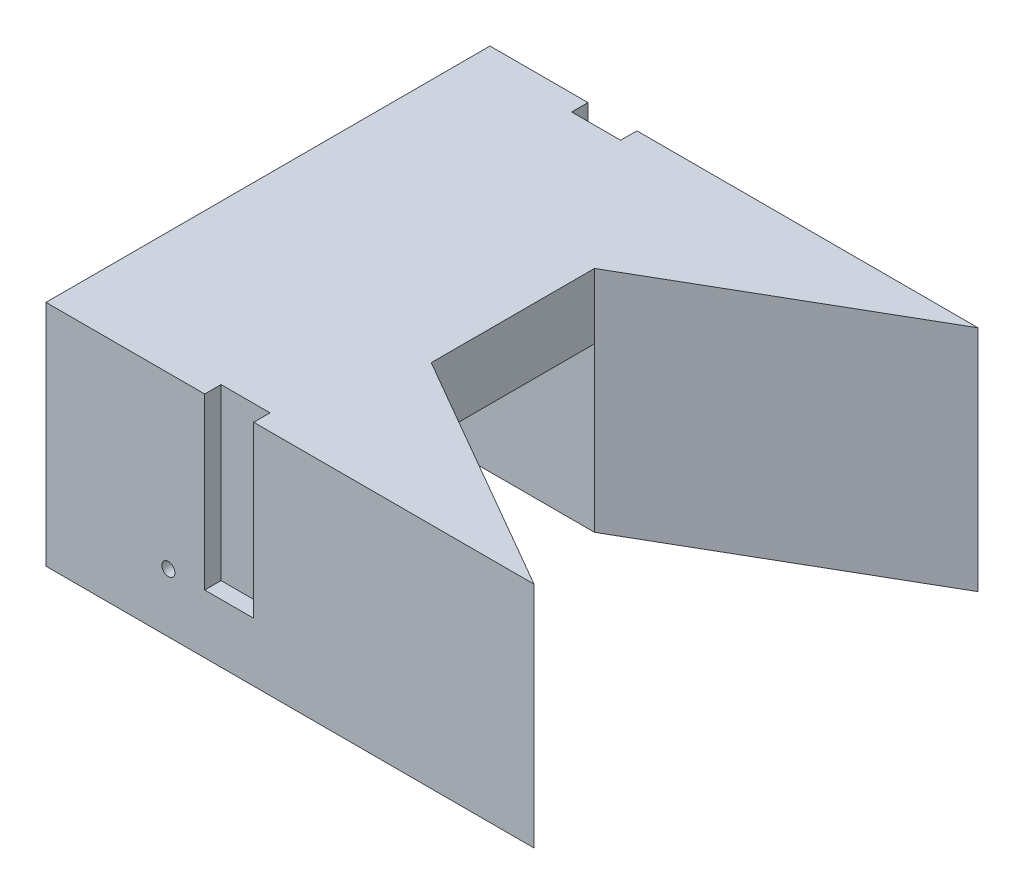
ISO-10303-21;
HEADER;
FILE_DESCRIPTION(('STEP AP214'),'2;1');
FILE_NAME('part.step','',(''),(''),'','','');
FILE_SCHEMA(('AUTOMOTIVE_DESIGN { 1 0 10303 214 1 1 1 1 }'));
ENDSEC;
DATA;
#1=APPLICATION_CONTEXT('core data for automotive mechanical design processes');
#2=APPLICATION_PROTOCOL_DEFINITION('international standard','automotive_design',2000,#1);
#3=PRODUCT_CONTEXT('',#1,'mechanical');
#4=PRODUCT('Part','Part','',(#3));
#5=PRODUCT_RELATED_PRODUCT_CATEGORY('part','',(#4));
#6=PRODUCT_DEFINITION_FORMATION('','',#4);
#7=PRODUCT_DEFINITION_CONTEXT('part definition',#1,'design');
#8=PRODUCT_DEFINITION('design','',#6,#7);
#9=PRODUCT_DEFINITION_SHAPE('','',#8);
#10=(LENGTH_UNIT() NAMED_UNIT(*) SI_UNIT(.MILLI.,.METRE.));
#11=(NAMED_UNIT(*) PLANE_ANGLE_UNIT() SI_UNIT($,.RADIAN.));
#12=(NAMED_UNIT(*) SI_UNIT($,.STERADIAN.) SOLID_ANGLE_UNIT());
#13=UNCERTAINTY_MEASURE_WITH_UNIT(LENGTH_MEASURE(1.E-05),#10,'distance_accuracy_value','');
#14=(GEOMETRIC_REPRESENTATION_CONTEXT(3) GLOBAL_UNCERTAINTY_ASSIGNED_CONTEXT((#13)) GLOBAL_UNIT_ASSIGNED_CONTEXT((#10,
#11,#12)) REPRESENTATION_CONTEXT('',''));
#15=CARTESIAN_POINT('',(0.,0.,0.));
#16=DIRECTION('',(0.,0.,1.));
#17=DIRECTION('',(1.,0.,0.));
#18=AXIS2_PLACEMENT_3D('',#15,#16,#17);
#19=CARTESIAN_POINT('',(-37.5,70.,-43.));
#20=DIRECTION('',(0.,0.,1.));
#21=DIRECTION('',(1.,0.,0.));
#22=AXIS2_PLACEMENT_3D('',#19,#20,#21);
#23=PLANE('',#22);
#24=CARTESIAN_POINT('',(0.,18.,-43.));
#25=DIRECTION('',(0.,0.,-1.));
#26=DIRECTION('',(-1.,0.,0.));
#27=AXIS2_PLACEMENT_3D('',#24,#25,#26);
#28=CIRCLE('',#27,7.);
#29=CARTESIAN_POINT('',(-7.,18.,-43.));
#30=VERTEX_POINT('',#29);
#31=EDGE_CURVE('E253',#30,#30,#28,.T.);
#32=ORIENTED_EDGE('',*,*,#31,.F.);
#33=EDGE_LOOP('',(#32));
#34=FACE_BOUND('',#33,.T.);
#35=DIRECTION('',(-1.,0.,0.));
#36=VECTOR('',#35,1.);
#37=CARTESIAN_POINT('',(37.5,50.,-43.));
#38=LINE('',#37,#36);
#39=CARTESIAN_POINT('',(37.5,50.,-43.));
#40=VERTEX_POINT('',#39);
#41=CARTESIAN_POINT('',(-37.5,50.,-43.));
#42=VERTEX_POINT('',#41);
#43=EDGE_CURVE('E55',#40,#42,#38,.T.);
#44=ORIENTED_EDGE('',*,*,#43,.F.);
#45=DIRECTION('',(0.,-1.,0.));
#46=VECTOR('',#45,1.);
#47=CARTESIAN_POINT('',(37.5,70.,-43.));
#48=LINE('',#47,#46);
#49=CARTESIAN_POINT('',(37.5,0.,-43.));
#50=VERTEX_POINT('',#49);
#51=EDGE_CURVE('E48',#40,#50,#48,.T.);
#52=ORIENTED_EDGE('',*,*,#51,.T.);
#53=DIRECTION('',(-1.,0.,0.));
#54=VECTOR('',#53,1.);
#55=CARTESIAN_POINT('',(-37.5,0.,-43.));
#56=LINE('',#55,#54);
#57=CARTESIAN_POINT('',(-37.5,0.,-43.));
#58=VERTEX_POINT('',#57);
#59=EDGE_CURVE('E300',#50,#58,#56,.T.);
#60=ORIENTED_EDGE('',*,*,#59,.T.);
#61=DIRECTION('',(0.,-1.,0.));
#62=VECTOR('',#61,1.);
#63=CARTESIAN_POINT('',(-37.5,70.,-43.));
#64=LINE('',#63,#62);
#65=EDGE_CURVE('E311',#42,#58,#64,.T.);
#66=ORIENTED_EDGE('',*,*,#65,.F.);
#67=EDGE_LOOP('',(#44,#52,#60,#66));
#68=FACE_BOUND('',#67,.T.);
#69=ADVANCED_FACE('F39',(#34,#68),#23,.F.);
#70=CARTESIAN_POINT('',(0.,18.,-41.));
#71=DIRECTION('',(0.,0.,1.));
#72=DIRECTION('',(1.,0.,0.));
#73=AXIS2_PLACEMENT_3D('',#70,#71,#72);
#74=CYLINDRICAL_SURFACE('',#73,2.);
#75=CARTESIAN_POINT('',(0.,18.,0.));
#76=DIRECTION('',(0.,0.,1.));
#77=DIRECTION('',(1.,0.,0.));
#78=AXIS2_PLACEMENT_3D('',#75,#76,#77);
#79=CIRCLE('',#78,2.);
#80=CARTESIAN_POINT('',(2.,18.,0.));
#81=VERTEX_POINT('',#80);
#82=EDGE_CURVE('E278',#81,#81,#79,.T.);
#83=ORIENTED_EDGE('',*,*,#82,.T.);
#84=EDGE_LOOP('',(#83));
#85=FACE_BOUND('',#84,.T.);
#86=CARTESIAN_POINT('',(0.,18.,-40.5));
#87=DIRECTION('',(0.,0.,-1.));
#88=DIRECTION('',(-1.,0.,0.));
#89=AXIS2_PLACEMENT_3D('',#86,#87,#88);
#90=CIRCLE('',#89,2.);
#91=CARTESIAN_POINT('',(-2.,18.,-40.5));
#92=VERTEX_POINT('',#91);
#93=EDGE_CURVE('E43',#92,#92,#90,.F.);
#94=ORIENTED_EDGE('',*,*,#93,.F.);
#95=EDGE_LOOP('',(#94));
#96=FACE_BOUND('',#95,.T.);
#97=ADVANCED_FACE('F365',(#85,#96),#74,.F.);
#98=CARTESIAN_POINT('',(37.5,70.,-43.));
#99=DIRECTION('',(-0.500000000000001,0.,0.866025403784438));
#100=DIRECTION('',(0.866025403784438,0.,0.500000000000001));
#101=AXIS2_PLACEMENT_3D('',#98,#99,#100);
#102=PLANE('',#101);
#103=DIRECTION('',(-0.866025403784438,0.,-0.500000000000001));
#104=VECTOR('',#103,1.);
#105=CARTESIAN_POINT('',(37.5,0.,-43.));
#106=LINE('',#105,#104);
#107=CARTESIAN_POINT('',(111.978184725462,0.,0.));
#108=VERTEX_POINT('',#107);
#109=EDGE_CURVE('E287',#108,#50,#106,.T.);
#110=ORIENTED_EDGE('',*,*,#109,.T.);
#111=ORIENTED_EDGE('',*,*,#51,.F.);
#112=CARTESIAN_POINT('',(37.5,70.,-43.));
#113=VERTEX_POINT('',#112);
#114=EDGE_CURVE('E11',#113,#40,#48,.T.);
#115=ORIENTED_EDGE('',*,*,#114,.F.);
#116=DIRECTION('',(-0.866025403784438,0.,-0.500000000000001));
#117=VECTOR('',#116,1.);
#118=CARTESIAN_POINT('',(37.5,70.,-43.));
#119=LINE('',#118,#117);
#120=CARTESIAN_POINT('',(111.978184725462,70.,0.));
#121=VERTEX_POINT('',#120);
#122=EDGE_CURVE('E288',#121,#113,#119,.T.);
#123=ORIENTED_EDGE('',*,*,#122,.F.);
#124=DIRECTION('',(0.,-1.,0.));
#125=VECTOR('',#124,1.);
#126=CARTESIAN_POINT('',(111.978184725462,70.,0.));
#127=LINE('',#126,#125);
#128=EDGE_CURVE('E297',#121,#108,#127,.T.);
#129=ORIENTED_EDGE('',*,*,#128,.T.);
#130=EDGE_LOOP('',(#110,#111,#115,#123,#129));
#131=FACE_BOUND('',#130,.T.);
#132=ADVANCED_FACE('F41',(#131),#102,.F.);
#133=CARTESIAN_POINT('',(-37.5,70.,-43.));
#134=DIRECTION('',(1.,0.,0.));
#135=DIRECTION('',(0.,0.,-1.));
#136=AXIS2_PLACEMENT_3D('',#133,#134,#135);
#137=PLANE('',#136);
#138=DIRECTION('',(0.,0.,1.));
#139=VECTOR('',#138,1.);
#140=CARTESIAN_POINT('',(-37.5,0.,-43.));
#141=LINE('',#140,#139);
#142=CARTESIAN_POINT('',(-37.5,0.,0.));
#143=VERTEX_POINT('',#142);
#144=EDGE_CURVE('E303',#58,#143,#141,.T.);
#145=ORIENTED_EDGE('',*,*,#144,.T.);
#146=DIRECTION('',(0.,-1.,0.));
#147=VECTOR('',#146,1.);
#148=CARTESIAN_POINT('',(-37.5,70.,0.));
#149=LINE('',#148,#147);
#150=CARTESIAN_POINT('',(-37.5,70.,0.));
#151=VERTEX_POINT('',#150);
#152=EDGE_CURVE('E308',#151,#143,#149,.T.);
#153=ORIENTED_EDGE('',*,*,#152,.F.);
#154=DIRECTION('',(0.,0.,1.));
#155=VECTOR('',#154,1.);
#156=CARTESIAN_POINT('',(-37.5,70.,-43.));
#157=LINE('',#156,#155);
#158=CARTESIAN_POINT('',(-37.4999999999999,70.0000000000003,-136.));
#159=VERTEX_POINT('',#158);
#160=EDGE_CURVE('E290',#159,#151,#157,.T.);
#161=ORIENTED_EDGE('',*,*,#160,.F.);
#162=DIRECTION('',(0.,-1.,0.));
#163=VECTOR('',#162,1.);
#164=CARTESIAN_POINT('',(-37.4999999999999,70.0000000000003,-136.));
#165=LINE('',#164,#163);
#166=CARTESIAN_POINT('',(-37.4999999999999,2.93385107874577E-13,-136.));
#167=VERTEX_POINT('',#166);
#168=EDGE_CURVE('E229',#159,#167,#165,.T.);
#169=ORIENTED_EDGE('',*,*,#168,.T.);
#170=DIRECTION('',(0.,0.,1.));
#171=VECTOR('',#170,1.);
#172=CARTESIAN_POINT('',(-37.4999999999999,2.91216703529606E-13,-92.9999999999999));
#173=LINE('',#172,#171);
#174=CARTESIAN_POINT('',(-37.4999999999999,2.91216703529606E-13,-92.9999999999999));
#175=VERTEX_POINT('',#174);
#176=EDGE_CURVE('E219',#167,#175,#173,.T.);
#177=ORIENTED_EDGE('',*,*,#176,.T.);
#178=DIRECTION('',(0.,-1.,0.));
#179=VECTOR('',#178,1.);
#180=CARTESIAN_POINT('',(-37.4999999999999,70.0000000000003,-92.9999999999999));
#181=LINE('',#180,#179);
#182=CARTESIAN_POINT('',(-37.4999999999999,50.,-92.9999999999999));
#183=VERTEX_POINT('',#182);
#184=EDGE_CURVE('E227',#183,#175,#181,.T.);
#185=ORIENTED_EDGE('',*,*,#184,.F.);
#186=DIRECTION('',(0.,0.,1.));
#187=VECTOR('',#186,1.);
#188=CARTESIAN_POINT('',(-37.5,50.,-170.6208734813));
#189=LINE('',#188,#187);
#190=EDGE_CURVE('E242',#183,#42,#189,.T.);
#191=ORIENTED_EDGE('',*,*,#190,.T.);
#192=ORIENTED_EDGE('',*,*,#65,.T.);
#193=EDGE_LOOP('',(#145,#153,#161,#169,#177,#185,#191,#192));
#194=FACE_BOUND('',#193,.T.);
#195=ADVANCED_FACE('F330',(#194),#137,.F.);
#196=CARTESIAN_POINT('',(-37.5,70.,0.));
#197=DIRECTION('',(0.,0.,-1.));
#198=DIRECTION('',(-1.,0.,0.));
#199=AXIS2_PLACEMENT_3D('',#196,#197,#198);
#200=PLANE('',#199);
#201=ORIENTED_EDGE('',*,*,#82,.F.);
#202=EDGE_LOOP('',(#201));
#203=FACE_BOUND('',#202,.T.);
#204=DIRECTION('',(1.,0.,0.));
#205=VECTOR('',#204,1.);
#206=CARTESIAN_POINT('',(-37.5,70.,0.));
#207=LINE('',#206,#205);
#208=CARTESIAN_POINT('',(26.1195461813654,70.,0.));
#209=VERTEX_POINT('',#208);
#210=EDGE_CURVE('E293',#209,#121,#207,.T.);
#211=ORIENTED_EDGE('',*,*,#210,.F.);
#212=DIRECTION('',(0.,1.,0.));
#213=VECTOR('',#212,1.);
#214=CARTESIAN_POINT('',(26.1195461813654,70.,0.));
#215=LINE('',#214,#213);
#216=CARTESIAN_POINT('',(26.1195461813654,18.,0.));
#217=VERTEX_POINT('',#216);
#218=EDGE_CURVE('E269',#217,#209,#215,.T.);
#219=ORIENTED_EDGE('',*,*,#218,.F.);
#220=DIRECTION('',(1.,0.,0.));
#221=VECTOR('',#220,1.);
#222=CARTESIAN_POINT('',(11.1195461813654,18.,0.));
#223=LINE('',#222,#221);
#224=CARTESIAN_POINT('',(11.1195461813654,18.,0.));
#225=VERTEX_POINT('',#224);
#226=EDGE_CURVE('E261',#225,#217,#223,.T.);
#227=ORIENTED_EDGE('',*,*,#226,.F.);
#228=DIRECTION('',(0.,-1.,0.));
#229=VECTOR('',#228,1.);
#230=CARTESIAN_POINT('',(11.1195461813654,70.,0.));
#231=LINE('',#230,#229);
#232=CARTESIAN_POINT('',(11.1195461813654,70.,0.));
#233=VERTEX_POINT('',#232);
#234=EDGE_CURVE('E271',#233,#225,#231,.T.);
#235=ORIENTED_EDGE('',*,*,#234,.F.);
#236=EDGE_CURVE('E294',#151,#233,#207,.T.);
#237=ORIENTED_EDGE('',*,*,#236,.F.);
#238=ORIENTED_EDGE('',*,*,#152,.T.);
#239=DIRECTION('',(1.,0.,0.));
#240=VECTOR('',#239,1.);
#241=CARTESIAN_POINT('',(-37.5,0.,0.));
#242=LINE('',#241,#240);
#243=EDGE_CURVE('E291',#143,#108,#242,.T.);
#244=ORIENTED_EDGE('',*,*,#243,.T.);
#245=ORIENTED_EDGE('',*,*,#128,.F.);
#246=EDGE_LOOP('',(#211,#219,#227,#235,#237,#238,#244,#245));
#247=FACE_BOUND('',#246,.T.);
#248=ADVANCED_FACE('F325',(#203,#247),#200,.F.);
#249=CARTESIAN_POINT('',(0.,70.,0.));
#250=DIRECTION('',(0.,-1.,0.));
#251=DIRECTION('',(0.,0.,-1.));
#252=AXIS2_PLACEMENT_3D('',#249,#250,#251);
#253=PLANE('',#252);
#254=DIRECTION('',(-1.,0.,0.));
#255=VECTOR('',#254,1.);
#256=CARTESIAN_POINT('',(11.1195461813654,70.,-5.));
#257=LINE('',#256,#255);
#258=CARTESIAN_POINT('',(26.1195461813654,70.,-5.));
#259=VERTEX_POINT('',#258);
#260=CARTESIAN_POINT('',(11.1195461813654,70.,-5.));
#261=VERTEX_POINT('',#260);
#262=EDGE_CURVE('E260',#259,#261,#257,.T.);
#263=ORIENTED_EDGE('',*,*,#262,.F.);
#264=DIRECTION('',(0.,0.,1.));
#265=VECTOR('',#264,1.);
#266=CARTESIAN_POINT('',(26.1195461813654,70.,-5.));
#267=LINE('',#266,#265);
#268=EDGE_CURVE('E268',#259,#209,#267,.T.);
#269=ORIENTED_EDGE('',*,*,#268,.T.);
#270=ORIENTED_EDGE('',*,*,#210,.T.);
#271=ORIENTED_EDGE('',*,*,#122,.T.);
#272=DIRECTION('',(0.,0.,1.));
#273=VECTOR('',#272,1.);
#274=CARTESIAN_POINT('',(37.5,70.,-170.6208734813));
#275=LINE('',#274,#273);
#276=CARTESIAN_POINT('',(37.5,70.,-93.));
#277=VERTEX_POINT('',#276);
#278=EDGE_CURVE('E240',#277,#113,#275,.T.);
#279=ORIENTED_EDGE('',*,*,#278,.F.);
#280=DIRECTION('',(0.866025403784438,0.,-0.5));
#281=VECTOR('',#280,1.);
#282=CARTESIAN_POINT('',(111.978184725462,70.0000000000003,-136.));
#283=LINE('',#282,#281);
#284=CARTESIAN_POINT('',(111.978184725462,70.0000000000003,-136.));
#285=VERTEX_POINT('',#284);
#286=EDGE_CURVE('E207',#277,#285,#283,.T.);
#287=ORIENTED_EDGE('',*,*,#286,.T.);
#288=DIRECTION('',(-1.,0.,0.));
#289=VECTOR('',#288,1.);
#290=CARTESIAN_POINT('',(111.978184725462,70.0000000000003,-136.));
#291=LINE('',#290,#289);
#292=CARTESIAN_POINT('',(7.50000000000012,70.0000000000004,-136.));
#293=VERTEX_POINT('',#292);
#294=EDGE_CURVE('E212',#285,#293,#291,.T.);
#295=ORIENTED_EDGE('',*,*,#294,.T.);
#296=DIRECTION('',(0.,0.,-1.));
#297=VECTOR('',#296,1.);
#298=CARTESIAN_POINT('',(7.50000000000012,70.0000000000004,-131.));
#299=LINE('',#298,#297);
#300=CARTESIAN_POINT('',(7.50000000000012,70.0000000000004,-131.));
#301=VERTEX_POINT('',#300);
#302=EDGE_CURVE('E172',#301,#293,#299,.T.);
#303=ORIENTED_EDGE('',*,*,#302,.F.);
#304=DIRECTION('',(1.,0.,0.));
#305=VECTOR('',#304,1.);
#306=CARTESIAN_POINT('',(7.50000000000012,70.0000000000004,-131.));
#307=LINE('',#306,#305);
#308=CARTESIAN_POINT('',(-7.4999999999999,70.0000000000004,-131.));
#309=VERTEX_POINT('',#308);
#310=EDGE_CURVE('E178',#309,#301,#307,.T.);
#311=ORIENTED_EDGE('',*,*,#310,.F.);
#312=DIRECTION('',(0.,0.,-1.));
#313=VECTOR('',#312,1.);
#314=CARTESIAN_POINT('',(-7.4999999999999,70.0000000000004,-131.));
#315=LINE('',#314,#313);
#316=CARTESIAN_POINT('',(-7.4999999999999,70.0000000000004,-136.));
#317=VERTEX_POINT('',#316);
#318=EDGE_CURVE('E161',#309,#317,#315,.T.);
#319=ORIENTED_EDGE('',*,*,#318,.T.);
#320=EDGE_CURVE('E210',#317,#159,#291,.T.);
#321=ORIENTED_EDGE('',*,*,#320,.T.);
#322=ORIENTED_EDGE('',*,*,#160,.T.);
#323=ORIENTED_EDGE('',*,*,#236,.T.);
#324=DIRECTION('',(0.,0.,1.));
#325=VECTOR('',#324,1.);
#326=CARTESIAN_POINT('',(11.1195461813654,70.,-5.));
#327=LINE('',#326,#325);
#328=EDGE_CURVE('E281',#261,#233,#327,.T.);
#329=ORIENTED_EDGE('',*,*,#328,.F.);
#330=EDGE_LOOP('',(#263,#269,#270,#271,#279,#287,#295,#303,#311,#319,#321,#322,#323,#329));
#331=FACE_BOUND('',#330,.T.);
#332=ADVANCED_FACE('F185',(#331),#253,.F.);
#333=CARTESIAN_POINT('',(0.,0.,0.));
#334=DIRECTION('',(0.,-1.,0.));
#335=DIRECTION('',(0.,0.,-1.));
#336=AXIS2_PLACEMENT_3D('',#333,#334,#335);
#337=PLANE('',#336);
#338=ORIENTED_EDGE('',*,*,#109,.F.);
#339=ORIENTED_EDGE('',*,*,#243,.F.);
#340=ORIENTED_EDGE('',*,*,#144,.F.);
#341=ORIENTED_EDGE('',*,*,#59,.F.);
#342=EDGE_LOOP('',(#338,#339,#340,#341));
#343=FACE_BOUND('',#342,.T.);
#344=ADVANCED_FACE('F319',(#343),#337,.T.);
#345=CARTESIAN_POINT('',(26.1195461813654,70.,-5.));
#346=DIRECTION('',(1.,0.,0.));
#347=DIRECTION('',(0.,0.,-1.));
#348=AXIS2_PLACEMENT_3D('',#345,#346,#347);
#349=PLANE('',#348);
#350=ORIENTED_EDGE('',*,*,#218,.T.);
#351=ORIENTED_EDGE('',*,*,#268,.F.);
#352=DIRECTION('',(0.,1.,0.));
#353=VECTOR('',#352,1.);
#354=CARTESIAN_POINT('',(26.1195461813654,70.,-5.));
#355=LINE('',#354,#353);
#356=CARTESIAN_POINT('',(26.1195461813654,18.,-5.));
#357=VERTEX_POINT('',#356);
#358=EDGE_CURVE('E63',#357,#259,#355,.T.);
#359=ORIENTED_EDGE('',*,*,#358,.F.);
#360=DIRECTION('',(0.,0.,1.));
#361=VECTOR('',#360,1.);
#362=CARTESIAN_POINT('',(26.1195461813654,18.,-5.));
#363=LINE('',#362,#361);
#364=EDGE_CURVE('E276',#357,#217,#363,.T.);
#365=ORIENTED_EDGE('',*,*,#364,.T.);
#366=EDGE_LOOP('',(#350,#351,#359,#365));
#367=FACE_BOUND('',#366,.T.);
#368=ADVANCED_FACE('F381',(#367),#349,.F.);
#369=CARTESIAN_POINT('',(11.1195461813654,18.,-5.));
#370=DIRECTION('',(0.,-1.,0.));
#371=DIRECTION('',(0.,0.,-1.));
#372=AXIS2_PLACEMENT_3D('',#369,#370,#371);
#373=PLANE('',#372);
#374=ORIENTED_EDGE('',*,*,#226,.T.);
#375=ORIENTED_EDGE('',*,*,#364,.F.);
#376=DIRECTION('',(1.,0.,0.));
#377=VECTOR('',#376,1.);
#378=CARTESIAN_POINT('',(11.1195461813654,18.,-5.));
#379=LINE('',#378,#377);
#380=CARTESIAN_POINT('',(11.1195461813654,18.,-5.));
#381=VERTEX_POINT('',#380);
#382=EDGE_CURVE('E266',#381,#357,#379,.T.);
#383=ORIENTED_EDGE('',*,*,#382,.F.);
#384=DIRECTION('',(0.,0.,1.));
#385=VECTOR('',#384,1.);
#386=CARTESIAN_POINT('',(11.1195461813654,18.,-5.));
#387=LINE('',#386,#385);
#388=EDGE_CURVE('E279',#381,#225,#387,.T.);
#389=ORIENTED_EDGE('',*,*,#388,.T.);
#390=EDGE_LOOP('',(#374,#375,#383,#389));
#391=FACE_BOUND('',#390,.T.);
#392=ADVANCED_FACE('F386',(#391),#373,.F.);
#393=CARTESIAN_POINT('',(11.1195461813654,70.,-5.));
#394=DIRECTION('',(-1.,0.,0.));
#395=DIRECTION('',(0.,0.,1.));
#396=AXIS2_PLACEMENT_3D('',#393,#394,#395);
#397=PLANE('',#396);
#398=ORIENTED_EDGE('',*,*,#234,.T.);
#399=ORIENTED_EDGE('',*,*,#388,.F.);
#400=DIRECTION('',(0.,-1.,0.));
#401=VECTOR('',#400,1.);
#402=CARTESIAN_POINT('',(11.1195461813654,70.,-5.));
#403=LINE('',#402,#401);
#404=EDGE_CURVE('E263',#261,#381,#403,.T.);
#405=ORIENTED_EDGE('',*,*,#404,.F.);
#406=ORIENTED_EDGE('',*,*,#328,.T.);
#407=EDGE_LOOP('',(#398,#399,#405,#406));
#408=FACE_BOUND('',#407,.T.);
#409=ADVANCED_FACE('F388',(#408),#397,.F.);
#410=CARTESIAN_POINT('',(0.,0.,-5.));
#411=DIRECTION('',(0.,0.,1.));
#412=DIRECTION('',(1.,0.,0.));
#413=AXIS2_PLACEMENT_3D('',#410,#411,#412);
#414=PLANE('',#413);
#415=ORIENTED_EDGE('',*,*,#358,.T.);
#416=ORIENTED_EDGE('',*,*,#262,.T.);
#417=ORIENTED_EDGE('',*,*,#404,.T.);
#418=ORIENTED_EDGE('',*,*,#382,.T.);
#419=EDGE_LOOP('',(#415,#416,#417,#418));
#420=FACE_BOUND('',#419,.T.);
#421=ADVANCED_FACE('F391',(#420),#414,.T.);
#422=CARTESIAN_POINT('',(0.,18.,-40.5));
#423=DIRECTION('',(0.,0.,-1.));
#424=DIRECTION('',(-1.,0.,0.));
#425=AXIS2_PLACEMENT_3D('',#422,#423,#424);
#426=PLANE('',#425);
#427=CARTESIAN_POINT('',(0.,18.,-40.5));
#428=DIRECTION('',(0.,0.,-1.));
#429=DIRECTION('',(-1.,0.,0.));
#430=AXIS2_PLACEMENT_3D('',#427,#428,#429);
#431=CIRCLE('',#430,7.);
#432=CARTESIAN_POINT('',(-7.,18.,-40.5));
#433=VERTEX_POINT('',#432);
#434=EDGE_CURVE('E254',#433,#433,#431,.T.);
#435=ORIENTED_EDGE('',*,*,#434,.T.);
#436=EDGE_LOOP('',(#435));
#437=FACE_BOUND('',#436,.T.);
#438=ORIENTED_EDGE('',*,*,#93,.T.);
#439=EDGE_LOOP('',(#438));
#440=FACE_BOUND('',#439,.T.);
#441=ADVANCED_FACE('F398',(#437,#440),#426,.T.);
#442=CARTESIAN_POINT('',(0.,18.,-40.5));
#443=DIRECTION('',(0.,0.,-1.));
#444=DIRECTION('',(-1.,0.,0.));
#445=AXIS2_PLACEMENT_3D('',#442,#443,#444);
#446=CYLINDRICAL_SURFACE('',#445,7.);
#447=ORIENTED_EDGE('',*,*,#434,.F.);
#448=EDGE_LOOP('',(#447));
#449=FACE_BOUND('',#448,.T.);
#450=ORIENTED_EDGE('',*,*,#31,.T.);
#451=EDGE_LOOP('',(#450));
#452=FACE_BOUND('',#451,.T.);
#453=ADVANCED_FACE('F399',(#449,#452),#446,.F.);
#454=CARTESIAN_POINT('',(37.5,70.,-170.6208734813));
#455=DIRECTION('',(-1.,0.,0.));
#456=DIRECTION('',(0.,0.,1.));
#457=AXIS2_PLACEMENT_3D('',#454,#455,#456);
#458=PLANE('',#457);
#459=DIRECTION('',(0.,-1.,0.));
#460=VECTOR('',#459,1.);
#461=CARTESIAN_POINT('',(37.5000000000001,70.0000000000003,-92.9999999999999));
#462=LINE('',#461,#460);
#463=CARTESIAN_POINT('',(37.5,50.,-93.));
#464=VERTEX_POINT('',#463);
#465=EDGE_CURVE('E224',#277,#464,#462,.T.);
#466=ORIENTED_EDGE('',*,*,#465,.F.);
#467=ORIENTED_EDGE('',*,*,#278,.T.);
#468=ORIENTED_EDGE('',*,*,#114,.T.);
#469=DIRECTION('',(0.,0.,1.));
#470=VECTOR('',#469,1.);
#471=CARTESIAN_POINT('',(37.5,50.,-170.6208734813));
#472=LINE('',#471,#470);
#473=EDGE_CURVE('E243',#464,#40,#472,.T.);
#474=ORIENTED_EDGE('',*,*,#473,.F.);
#475=EDGE_LOOP('',(#466,#467,#468,#474));
#476=FACE_BOUND('',#475,.T.);
#477=ADVANCED_FACE('F348',(#476),#458,.F.);
#478=CARTESIAN_POINT('',(37.5,50.,-170.6208734813));
#479=DIRECTION('',(0.,1.,0.));
#480=DIRECTION('',(0.,0.,1.));
#481=AXIS2_PLACEMENT_3D('',#478,#479,#480);
#482=PLANE('',#481);
#483=DIRECTION('',(-1.,0.,0.));
#484=VECTOR('',#483,1.);
#485=CARTESIAN_POINT('',(37.5,50.,-93.));
#486=LINE('',#485,#484);
#487=EDGE_CURVE('E248',#464,#183,#486,.T.);
#488=ORIENTED_EDGE('',*,*,#487,.F.);
#489=ORIENTED_EDGE('',*,*,#473,.T.);
#490=ORIENTED_EDGE('',*,*,#43,.T.);
#491=ORIENTED_EDGE('',*,*,#190,.F.);
#492=EDGE_LOOP('',(#488,#489,#490,#491));
#493=FACE_BOUND('',#492,.T.);
#494=ADVANCED_FACE('F346',(#493),#482,.F.);
#495=CARTESIAN_POINT('',(37.5000000000001,70.0000000000003,-92.9999999999999));
#496=DIRECTION('',(0.,0.,-1.));
#497=DIRECTION('',(-1.,0.,0.));
#498=AXIS2_PLACEMENT_3D('',#495,#496,#497);
#499=PLANE('',#498);
#500=CARTESIAN_POINT('',(1.14491749414469E-13,18.0000000000003,-92.9999999999999));
#501=DIRECTION('',(0.,0.,-1.));
#502=DIRECTION('',(-1.,0.,0.));
#503=AXIS2_PLACEMENT_3D('',#500,#501,#502);
#504=CIRCLE('',#503,3.);
#505=CARTESIAN_POINT('',(-2.99999999999989,18.0000000000003,-92.9999999999999));
#506=VERTEX_POINT('',#505);
#507=EDGE_CURVE('E202',#506,#506,#504,.T.);
#508=ORIENTED_EDGE('',*,*,#507,.T.);
#509=EDGE_LOOP('',(#508));
#510=FACE_BOUND('',#509,.T.);
#511=CARTESIAN_POINT('',(37.5000000000001,2.96420873957537E-13,-92.9999999999999));
#512=VERTEX_POINT('',#511);
#513=EDGE_CURVE('E214',#464,#512,#462,.T.);
#514=ORIENTED_EDGE('',*,*,#513,.F.);
#515=ORIENTED_EDGE('',*,*,#487,.T.);
#516=ORIENTED_EDGE('',*,*,#184,.T.);
#517=DIRECTION('',(1.,0.,0.));
#518=VECTOR('',#517,1.);
#519=CARTESIAN_POINT('',(37.5000000000001,2.96420873957537E-13,-92.9999999999999));
#520=LINE('',#519,#518);
#521=EDGE_CURVE('E211',#175,#512,#520,.T.);
#522=ORIENTED_EDGE('',*,*,#521,.T.);
#523=EDGE_LOOP('',(#514,#515,#516,#522));
#524=FACE_BOUND('',#523,.T.);
#525=ADVANCED_FACE('F343',(#510,#524),#499,.F.);
#526=CARTESIAN_POINT('',(1.14491749414469E-13,18.0000000000003,-92.9999999999999));
#527=DIRECTION('',(0.,0.,-1.));
#528=DIRECTION('',(-1.,0.,0.));
#529=AXIS2_PLACEMENT_3D('',#526,#527,#528);
#530=CYLINDRICAL_SURFACE('',#529,3.);
#531=ORIENTED_EDGE('',*,*,#507,.F.);
#532=EDGE_LOOP('',(#531));
#533=FACE_BOUND('',#532,.T.);
#534=CARTESIAN_POINT('',(1.17961196366423E-13,18.0000000000003,-106.));
#535=DIRECTION('',(0.,0.,-1.));
#536=DIRECTION('',(-1.,0.,0.));
#537=AXIS2_PLACEMENT_3D('',#534,#535,#536);
#538=CIRCLE('',#537,3.);
#539=CARTESIAN_POINT('',(-2.99999999999988,18.0000000000003,-106.));
#540=VERTEX_POINT('',#539);
#541=EDGE_CURVE('E201',#540,#540,#538,.F.);
#542=ORIENTED_EDGE('',*,*,#541,.F.);
#543=EDGE_LOOP('',(#542));
#544=FACE_BOUND('',#543,.T.);
#545=ADVANCED_FACE('F354',(#533,#544),#530,.F.);
#546=CARTESIAN_POINT('',(111.978184725462,70.0000000000003,-136.));
#547=DIRECTION('',(-0.5,0.,-0.866025403784438));
#548=DIRECTION('',(-0.866025403784438,0.,0.5));
#549=AXIS2_PLACEMENT_3D('',#546,#547,#548);
#550=PLANE('',#549);
#551=DIRECTION('',(0.866025403784438,0.,-0.5));
#552=VECTOR('',#551,1.);
#553=CARTESIAN_POINT('',(111.978184725462,3.12467066110322E-13,-136.));
#554=LINE('',#553,#552);
#555=CARTESIAN_POINT('',(111.978184725462,3.12467066110322E-13,-136.));
#556=VERTEX_POINT('',#555);
#557=EDGE_CURVE('E205',#512,#556,#554,.T.);
#558=ORIENTED_EDGE('',*,*,#557,.T.);
#559=DIRECTION('',(0.,-1.,0.));
#560=VECTOR('',#559,1.);
#561=CARTESIAN_POINT('',(111.978184725462,70.0000000000003,-136.));
#562=LINE('',#561,#560);
#563=EDGE_CURVE('E232',#285,#556,#562,.T.);
#564=ORIENTED_EDGE('',*,*,#563,.F.);
#565=ORIENTED_EDGE('',*,*,#286,.F.);
#566=ORIENTED_EDGE('',*,*,#465,.T.);
#567=ORIENTED_EDGE('',*,*,#513,.T.);
#568=EDGE_LOOP('',(#558,#564,#565,#566,#567));
#569=FACE_BOUND('',#568,.T.);
#570=ADVANCED_FACE('F352',(#569),#550,.F.);
#571=CARTESIAN_POINT('',(111.978184725462,70.0000000000003,-136.));
#572=DIRECTION('',(0.,0.,1.));
#573=DIRECTION('',(1.,0.,0.));
#574=AXIS2_PLACEMENT_3D('',#571,#572,#573);
#575=PLANE('',#574);
#576=ORIENTED_EDGE('',*,*,#320,.F.);
#577=DIRECTION('',(0.,1.,0.));
#578=VECTOR('',#577,1.);
#579=CARTESIAN_POINT('',(-7.4999999999999,70.0000000000004,-136.));
#580=LINE('',#579,#578);
#581=CARTESIAN_POINT('',(-7.49999999999988,18.0000000000003,-136.));
#582=VERTEX_POINT('',#581);
#583=EDGE_CURVE('E167',#582,#317,#580,.T.);
#584=ORIENTED_EDGE('',*,*,#583,.F.);
#585=CARTESIAN_POINT('',(1.21430643318376E-13,18.0000000000003,-136.));
#586=DIRECTION('',(0.,0.,1.));
#587=DIRECTION('',(1.,0.,0.));
#588=AXIS2_PLACEMENT_3D('',#585,#586,#587);
#589=CIRCLE('',#588,7.5);
#590=CARTESIAN_POINT('',(7.50000000000012,18.0000000000003,-136.));
#591=VERTEX_POINT('',#590);
#592=EDGE_CURVE('E206',#591,#582,#589,.F.);
#593=ORIENTED_EDGE('',*,*,#592,.F.);
#594=DIRECTION('',(0.,-1.,0.));
#595=VECTOR('',#594,1.);
#596=CARTESIAN_POINT('',(7.50000000000012,70.0000000000004,-136.));
#597=LINE('',#596,#595);
#598=EDGE_CURVE('E182',#293,#591,#597,.T.);
#599=ORIENTED_EDGE('',*,*,#598,.F.);
#600=ORIENTED_EDGE('',*,*,#294,.F.);
#601=ORIENTED_EDGE('',*,*,#563,.T.);
#602=DIRECTION('',(-1.,0.,0.));
#603=VECTOR('',#602,1.);
#604=CARTESIAN_POINT('',(111.978184725462,3.12467066110322E-13,-136.));
#605=LINE('',#604,#603);
#606=EDGE_CURVE('E217',#556,#167,#605,.T.);
#607=ORIENTED_EDGE('',*,*,#606,.T.);
#608=ORIENTED_EDGE('',*,*,#168,.F.);
#609=EDGE_LOOP('',(#576,#584,#593,#599,#600,#601,#607,#608));
#610=FACE_BOUND('',#609,.T.);
#611=ADVANCED_FACE('F334',(#610),#575,.F.);
#612=CARTESIAN_POINT('',(1.31838984174237E-13,3.00324001778485E-13,-136.));
#613=DIRECTION('',(0.,-1.,0.));
#614=DIRECTION('',(0.,0.,1.));
#615=AXIS2_PLACEMENT_3D('',#612,#613,#614);
#616=PLANE('',#615);
#617=ORIENTED_EDGE('',*,*,#557,.F.);
#618=ORIENTED_EDGE('',*,*,#521,.F.);
#619=ORIENTED_EDGE('',*,*,#176,.F.);
#620=ORIENTED_EDGE('',*,*,#606,.F.);
#621=EDGE_LOOP('',(#617,#618,#619,#620));
#622=FACE_BOUND('',#621,.T.);
#623=ADVANCED_FACE('F338',(#622),#616,.T.);
#624=CARTESIAN_POINT('',(1.21430643318376E-13,18.0000000000003,-136.000012));
#625=DIRECTION('',(0.,0.,1.));
#626=DIRECTION('',(1.,0.,0.));
#627=AXIS2_PLACEMENT_3D('',#624,#625,#626);
#628=CYLINDRICAL_SURFACE('',#627,7.5);
#629=DIRECTION('',(0.,0.,-1.));
#630=VECTOR('',#629,1.);
#631=CARTESIAN_POINT('',(-7.49999999999988,18.0000000000003,-131.));
#632=LINE('',#631,#630);
#633=CARTESIAN_POINT('',(-7.49999999999988,18.0000000000003,-131.));
#634=VERTEX_POINT('',#633);
#635=EDGE_CURVE('E192',#634,#582,#632,.T.);
#636=ORIENTED_EDGE('',*,*,#635,.F.);
#637=CARTESIAN_POINT('',(1.21430643318376E-13,18.0000000000003,-131.));
#638=DIRECTION('',(0.,0.,-1.));
#639=DIRECTION('',(-1.,0.,0.));
#640=AXIS2_PLACEMENT_3D('',#637,#638,#639);
#641=CIRCLE('',#640,7.5);
#642=CARTESIAN_POINT('',(7.50000000000012,18.0000000000003,-131.));
#643=VERTEX_POINT('',#642);
#644=EDGE_CURVE('E181',#634,#643,#641,.T.);
#645=ORIENTED_EDGE('',*,*,#644,.T.);
#646=DIRECTION('',(0.,0.,-1.));
#647=VECTOR('',#646,1.);
#648=CARTESIAN_POINT('',(7.50000000000012,18.0000000000003,-131.));
#649=LINE('',#648,#647);
#650=EDGE_CURVE('E195',#643,#591,#649,.T.);
#651=ORIENTED_EDGE('',*,*,#650,.T.);
#652=ORIENTED_EDGE('',*,*,#592,.T.);
#653=EDGE_LOOP('',(#636,#645,#651,#652));
#654=FACE_BOUND('',#653,.T.);
#655=CARTESIAN_POINT('',(1.17961196366423E-13,18.0000000000003,-106.));
#656=DIRECTION('',(0.,0.,-1.));
#657=DIRECTION('',(-1.,0.,0.));
#658=AXIS2_PLACEMENT_3D('',#655,#656,#657);
#659=CIRCLE('',#658,7.5);
#660=CARTESIAN_POINT('',(-7.49999999999988,18.0000000000003,-106.));
#661=VERTEX_POINT('',#660);
#662=EDGE_CURVE('E194',#661,#661,#659,.T.);
#663=ORIENTED_EDGE('',*,*,#662,.F.);
#664=EDGE_LOOP('',(#663));
#665=FACE_BOUND('',#664,.T.);
#666=ADVANCED_FACE('F417',(#654,#665),#628,.F.);
#667=CARTESIAN_POINT('',(1.17961196366423E-13,18.0000000000003,-106.));
#668=DIRECTION('',(0.,0.,-1.));
#669=DIRECTION('',(-1.,0.,0.));
#670=AXIS2_PLACEMENT_3D('',#667,#668,#669);
#671=PLANE('',#670);
#672=ORIENTED_EDGE('',*,*,#662,.T.);
#673=EDGE_LOOP('',(#672));
#674=FACE_BOUND('',#673,.T.);
#675=ORIENTED_EDGE('',*,*,#541,.T.);
#676=EDGE_LOOP('',(#675));
#677=FACE_BOUND('',#676,.T.);
#678=ADVANCED_FACE('F421',(#674,#677),#671,.T.);
#679=CARTESIAN_POINT('',(-7.4999999999999,70.0000000000004,-131.));
#680=DIRECTION('',(-1.,0.,0.));
#681=DIRECTION('',(0.,1.,0.));
#682=AXIS2_PLACEMENT_3D('',#679,#680,#681);
#683=PLANE('',#682);
#684=ORIENTED_EDGE('',*,*,#583,.T.);
#685=ORIENTED_EDGE('',*,*,#318,.F.);
#686=DIRECTION('',(0.,1.,0.));
#687=VECTOR('',#686,1.);
#688=CARTESIAN_POINT('',(-7.4999999999999,70.0000000000004,-131.));
#689=LINE('',#688,#687);
#690=EDGE_CURVE('E164',#634,#309,#689,.T.);
#691=ORIENTED_EDGE('',*,*,#690,.F.);
#692=ORIENTED_EDGE('',*,*,#635,.T.);
#693=EDGE_LOOP('',(#684,#685,#691,#692));
#694=FACE_BOUND('',#693,.T.);
#695=ADVANCED_FACE('F163',(#694),#683,.F.);
#696=CARTESIAN_POINT('',(7.50000000000012,70.0000000000004,-131.));
#697=DIRECTION('',(1.,0.,0.));
#698=DIRECTION('',(0.,-1.,0.));
#699=AXIS2_PLACEMENT_3D('',#696,#697,#698);
#700=PLANE('',#699);
#701=ORIENTED_EDGE('',*,*,#598,.T.);
#702=ORIENTED_EDGE('',*,*,#650,.F.);
#703=DIRECTION('',(0.,-1.,0.));
#704=VECTOR('',#703,1.);
#705=CARTESIAN_POINT('',(7.50000000000012,70.0000000000004,-131.));
#706=LINE('',#705,#704);
#707=EDGE_CURVE('E173',#301,#643,#706,.T.);
#708=ORIENTED_EDGE('',*,*,#707,.F.);
#709=ORIENTED_EDGE('',*,*,#302,.T.);
#710=EDGE_LOOP('',(#701,#702,#708,#709));
#711=FACE_BOUND('',#710,.T.);
#712=ADVANCED_FACE('F428',(#711),#700,.F.);
#713=CARTESIAN_POINT('',(1.28369537222284E-13,3.00107161343988E-13,-131.));
#714=DIRECTION('',(0.,0.,-1.));
#715=DIRECTION('',(-1.,0.,0.));
#716=AXIS2_PLACEMENT_3D('',#713,#714,#715);
#717=PLANE('',#716);
#718=ORIENTED_EDGE('',*,*,#690,.T.);
#719=ORIENTED_EDGE('',*,*,#310,.T.);
#720=ORIENTED_EDGE('',*,*,#707,.T.);
#721=ORIENTED_EDGE('',*,*,#644,.F.);
#722=EDGE_LOOP('',(#718,#719,#720,#721));
#723=FACE_BOUND('',#722,.T.);
#724=ADVANCED_FACE('F177',(#723),#717,.T.);
#725=CLOSED_SHELL('',(#69,#97,#132,#195,#248,#332,#344,#368,#392,#409,#421,#441,#453,#477,#494,
#525,#545,#570,#611,#623,#666,#678,#695,#712,#724));
#726=MANIFOLD_SOLID_BREP('B2',#725);
#727=ADVANCED_BREP_SHAPE_REPRESENTATION('',(#18,#726),#14);
#728=SHAPE_DEFINITION_REPRESENTATION(#9,#727);
ENDSEC;
END-ISO-10303-21;
